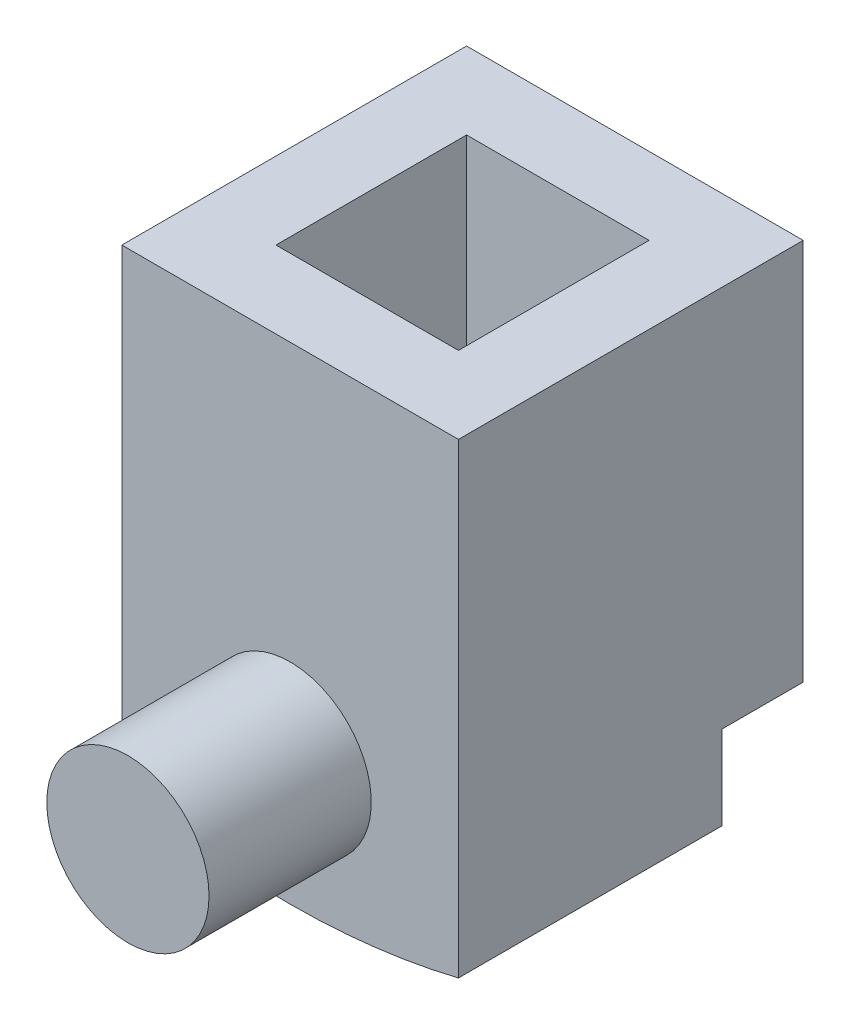
ISO-10303-21;
HEADER;
FILE_DESCRIPTION(('STEP AP214'),'2;1');
FILE_NAME('part.step','',(''),(''),'','','');
FILE_SCHEMA(('AUTOMOTIVE_DESIGN { 1 0 10303 214 1 1 1 1 }'));
ENDSEC;
DATA;
#1=APPLICATION_CONTEXT('core data for automotive mechanical design processes');
#2=APPLICATION_PROTOCOL_DEFINITION('international standard','automotive_design',2000,#1);
#3=PRODUCT_CONTEXT('',#1,'mechanical');
#4=PRODUCT('Part','Part','',(#3));
#5=PRODUCT_RELATED_PRODUCT_CATEGORY('part','',(#4));
#6=PRODUCT_DEFINITION_FORMATION('','',#4);
#7=PRODUCT_DEFINITION_CONTEXT('part definition',#1,'design');
#8=PRODUCT_DEFINITION('design','',#6,#7);
#9=PRODUCT_DEFINITION_SHAPE('','',#8);
#10=(LENGTH_UNIT() NAMED_UNIT(*) SI_UNIT(.MILLI.,.METRE.));
#11=(NAMED_UNIT(*) PLANE_ANGLE_UNIT() SI_UNIT($,.RADIAN.));
#12=(NAMED_UNIT(*) SI_UNIT($,.STERADIAN.) SOLID_ANGLE_UNIT());
#13=UNCERTAINTY_MEASURE_WITH_UNIT(LENGTH_MEASURE(1.E-05),#10,'distance_accuracy_value','');
#14=(GEOMETRIC_REPRESENTATION_CONTEXT(3) GLOBAL_UNCERTAINTY_ASSIGNED_CONTEXT((#13)) GLOBAL_UNIT_ASSIGNED_CONTEXT((#10,
#11,#12)) REPRESENTATION_CONTEXT('',''));
#15=CARTESIAN_POINT('',(0.,0.,0.));
#16=DIRECTION('',(0.,0.,1.));
#17=DIRECTION('',(1.,0.,0.));
#18=AXIS2_PLACEMENT_3D('',#15,#16,#17);
#19=CARTESIAN_POINT('',(-4.15,12.,4.25));
#20=DIRECTION('',(1.,0.,0.));
#21=DIRECTION('',(0.,0.,-1.));
#22=AXIS2_PLACEMENT_3D('',#19,#20,#21);
#23=PLANE('',#22);
#24=DIRECTION('',(0.,0.,-1.));
#25=VECTOR('',#24,1.);
#26=CARTESIAN_POINT('',(-4.15,2.56589473721308,-2.25));
#27=LINE('',#26,#25);
#28=CARTESIAN_POINT('',(-4.15,2.56589473721308,-2.25));
#29=VERTEX_POINT('',#28);
#30=CARTESIAN_POINT('',(-4.15,2.56589473721308,-4.25));
#31=VERTEX_POINT('',#30);
#32=EDGE_CURVE('E132',#29,#31,#27,.T.);
#33=ORIENTED_EDGE('',*,*,#32,.F.);
#34=DIRECTION('',(0.,1.,0.));
#35=VECTOR('',#34,1.);
#36=CARTESIAN_POINT('',(-4.15,0.,-2.25));
#37=LINE('',#36,#35);
#38=CARTESIAN_POINT('',(-4.15,0.499191195710718,-2.25));
#39=VERTEX_POINT('',#38);
#40=EDGE_CURVE('E133',#39,#29,#37,.T.);
#41=ORIENTED_EDGE('',*,*,#40,.F.);
#42=DIRECTION('',(0.,0.,-1.));
#43=VECTOR('',#42,1.);
#44=CARTESIAN_POINT('',(-4.15,0.499191195710718,5.75));
#45=LINE('',#44,#43);
#46=CARTESIAN_POINT('',(-4.15,0.499191195710718,4.25));
#47=VERTEX_POINT('',#46);
#48=EDGE_CURVE('E54',#47,#39,#45,.T.);
#49=ORIENTED_EDGE('',*,*,#48,.F.);
#50=DIRECTION('',(0.,-1.,0.));
#51=VECTOR('',#50,1.);
#52=CARTESIAN_POINT('',(-4.15,12.,4.25));
#53=LINE('',#52,#51);
#54=CARTESIAN_POINT('',(-4.15,12.,4.25));
#55=VERTEX_POINT('',#54);
#56=EDGE_CURVE('E211',#55,#47,#53,.T.);
#57=ORIENTED_EDGE('',*,*,#56,.F.);
#58=DIRECTION('',(0.,0.,1.));
#59=VECTOR('',#58,1.);
#60=CARTESIAN_POINT('',(-4.15,12.,4.25));
#61=LINE('',#60,#59);
#62=CARTESIAN_POINT('',(-4.15,12.,-4.25));
#63=VERTEX_POINT('',#62);
#64=EDGE_CURVE('E195',#63,#55,#61,.T.);
#65=ORIENTED_EDGE('',*,*,#64,.F.);
#66=DIRECTION('',(0.,-1.,0.));
#67=VECTOR('',#66,1.);
#68=CARTESIAN_POINT('',(-4.15,12.,-4.25));
#69=LINE('',#68,#67);
#70=EDGE_CURVE('E204',#63,#31,#69,.T.);
#71=ORIENTED_EDGE('',*,*,#70,.T.);
#72=EDGE_LOOP('',(#33,#41,#49,#57,#65,#71));
#73=FACE_BOUND('',#72,.T.);
#74=ADVANCED_FACE('F32',(#73),#23,.F.);
#75=CARTESIAN_POINT('',(4.15,12.,4.25));
#76=DIRECTION('',(-1.,0.,0.));
#77=DIRECTION('',(0.,0.,1.));
#78=AXIS2_PLACEMENT_3D('',#75,#76,#77);
#79=PLANE('',#78);
#80=DIRECTION('',(0.,0.,-1.));
#81=VECTOR('',#80,1.);
#82=CARTESIAN_POINT('',(4.15,2.56589473721308,-2.25));
#83=LINE('',#82,#81);
#84=CARTESIAN_POINT('',(4.15,2.56589473721308,-2.25));
#85=VERTEX_POINT('',#84);
#86=CARTESIAN_POINT('',(4.15,2.56589473721308,-4.25));
#87=VERTEX_POINT('',#86);
#88=EDGE_CURVE('E123',#85,#87,#83,.T.);
#89=ORIENTED_EDGE('',*,*,#88,.T.);
#90=DIRECTION('',(0.,-1.,0.));
#91=VECTOR('',#90,1.);
#92=CARTESIAN_POINT('',(4.15,12.,-4.25));
#93=LINE('',#92,#91);
#94=CARTESIAN_POINT('',(4.15,12.,-4.25));
#95=VERTEX_POINT('',#94);
#96=EDGE_CURVE('E207',#95,#87,#93,.T.);
#97=ORIENTED_EDGE('',*,*,#96,.F.);
#98=DIRECTION('',(0.,0.,-1.));
#99=VECTOR('',#98,1.);
#100=CARTESIAN_POINT('',(4.15,12.,4.25));
#101=LINE('',#100,#99);
#102=CARTESIAN_POINT('',(4.15,12.,4.25));
#103=VERTEX_POINT('',#102);
#104=EDGE_CURVE('E200',#103,#95,#101,.T.);
#105=ORIENTED_EDGE('',*,*,#104,.F.);
#106=DIRECTION('',(0.,-1.,0.));
#107=VECTOR('',#106,1.);
#108=CARTESIAN_POINT('',(4.15,12.,4.25));
#109=LINE('',#108,#107);
#110=CARTESIAN_POINT('',(4.15,0.499191195710718,4.25));
#111=VERTEX_POINT('',#110);
#112=EDGE_CURVE('E209',#103,#111,#109,.T.);
#113=ORIENTED_EDGE('',*,*,#112,.T.);
#114=DIRECTION('',(0.,0.,-1.));
#115=VECTOR('',#114,1.);
#116=CARTESIAN_POINT('',(4.15,0.499191195710718,5.75));
#117=LINE('',#116,#115);
#118=CARTESIAN_POINT('',(4.15,0.499191195710718,-2.25));
#119=VERTEX_POINT('',#118);
#120=EDGE_CURVE('E143',#119,#111,#117,.F.);
#121=ORIENTED_EDGE('',*,*,#120,.F.);
#122=DIRECTION('',(0.,-1.,0.));
#123=VECTOR('',#122,1.);
#124=CARTESIAN_POINT('',(4.15,0.,-2.25));
#125=LINE('',#124,#123);
#126=EDGE_CURVE('E46',#85,#119,#125,.T.);
#127=ORIENTED_EDGE('',*,*,#126,.F.);
#128=EDGE_LOOP('',(#89,#97,#105,#113,#121,#127));
#129=FACE_BOUND('',#128,.T.);
#130=ADVANCED_FACE('F141',(#129),#79,.F.);
#131=CARTESIAN_POINT('',(-4.15,12.,-4.25));
#132=DIRECTION('',(0.,0.,1.));
#133=DIRECTION('',(1.,0.,0.));
#134=AXIS2_PLACEMENT_3D('',#131,#132,#133);
#135=PLANE('',#134);
#136=CARTESIAN_POINT('',(0.,17.5,-4.25));
#137=DIRECTION('',(0.,0.,-1.));
#138=DIRECTION('',(-1.,0.,0.));
#139=AXIS2_PLACEMENT_3D('',#136,#137,#138);
#140=CIRCLE('',#139,15.5);
#141=EDGE_CURVE('E128',#87,#31,#140,.T.);
#142=ORIENTED_EDGE('',*,*,#141,.T.);
#143=ORIENTED_EDGE('',*,*,#70,.F.);
#144=DIRECTION('',(-1.,0.,0.));
#145=VECTOR('',#144,1.);
#146=CARTESIAN_POINT('',(-4.15,12.,-4.25));
#147=LINE('',#146,#145);
#148=EDGE_CURVE('E202',#95,#63,#147,.T.);
#149=ORIENTED_EDGE('',*,*,#148,.F.);
#150=ORIENTED_EDGE('',*,*,#96,.T.);
#151=EDGE_LOOP('',(#142,#143,#149,#150));
#152=FACE_BOUND('',#151,.T.);
#153=ADVANCED_FACE('F258',(#152),#135,.F.);
#154=CARTESIAN_POINT('',(2.25,12.,2.35));
#155=DIRECTION('',(-1.,0.,0.));
#156=DIRECTION('',(0.,0.,1.));
#157=AXIS2_PLACEMENT_3D('',#154,#155,#156);
#158=PLANE('',#157);
#159=DIRECTION('',(0.,-1.,0.));
#160=VECTOR('',#159,1.);
#161=CARTESIAN_POINT('',(2.25,12.,-2.35));
#162=LINE('',#161,#160);
#163=CARTESIAN_POINT('',(2.25,12.,-2.35));
#164=VERTEX_POINT('',#163);
#165=CARTESIAN_POINT('',(2.25,2.164175926935,-2.35));
#166=VERTEX_POINT('',#165);
#167=EDGE_CURVE('E192',#164,#166,#162,.T.);
#168=ORIENTED_EDGE('',*,*,#167,.T.);
#169=DIRECTION('',(0.,0.,-1.));
#170=VECTOR('',#169,1.);
#171=CARTESIAN_POINT('',(2.25,2.164175926935,-2.25));
#172=LINE('',#171,#170);
#173=CARTESIAN_POINT('',(2.25,2.164175926935,-2.25));
#174=VERTEX_POINT('',#173);
#175=EDGE_CURVE('E159',#166,#174,#172,.F.);
#176=ORIENTED_EDGE('',*,*,#175,.T.);
#177=DIRECTION('',(0.,-1.,0.));
#178=VECTOR('',#177,1.);
#179=CARTESIAN_POINT('',(2.25,12.,-2.25));
#180=LINE('',#179,#178);
#181=CARTESIAN_POINT('',(2.25,0.145245608191395,-2.25));
#182=VERTEX_POINT('',#181);
#183=EDGE_CURVE('E137',#174,#182,#180,.T.);
#184=ORIENTED_EDGE('',*,*,#183,.T.);
#185=DIRECTION('',(0.,0.,-1.));
#186=VECTOR('',#185,1.);
#187=CARTESIAN_POINT('',(2.25,0.145245608191395,5.75));
#188=LINE('',#187,#186);
#189=CARTESIAN_POINT('',(2.25,0.145245608191395,2.35));
#190=VERTEX_POINT('',#189);
#191=EDGE_CURVE('E167',#182,#190,#188,.F.);
#192=ORIENTED_EDGE('',*,*,#191,.T.);
#193=DIRECTION('',(0.,-1.,0.));
#194=VECTOR('',#193,1.);
#195=CARTESIAN_POINT('',(2.25,12.,2.35));
#196=LINE('',#195,#194);
#197=CARTESIAN_POINT('',(2.25,12.,2.35));
#198=VERTEX_POINT('',#197);
#199=EDGE_CURVE('E183',#198,#190,#196,.T.);
#200=ORIENTED_EDGE('',*,*,#199,.F.);
#201=DIRECTION('',(0.,0.,-1.));
#202=VECTOR('',#201,1.);
#203=CARTESIAN_POINT('',(2.25,12.,2.35));
#204=LINE('',#203,#202);
#205=EDGE_CURVE('E174',#198,#164,#204,.T.);
#206=ORIENTED_EDGE('',*,*,#205,.T.);
#207=EDGE_LOOP('',(#168,#176,#184,#192,#200,#206));
#208=FACE_BOUND('',#207,.T.);
#209=ADVANCED_FACE('F233',(#208),#158,.T.);
#210=CARTESIAN_POINT('',(-2.25,12.,-2.35));
#211=DIRECTION('',(0.,0.,1.));
#212=DIRECTION('',(1.,0.,0.));
#213=AXIS2_PLACEMENT_3D('',#210,#211,#212);
#214=PLANE('',#213);
#215=DIRECTION('',(0.,-1.,0.));
#216=VECTOR('',#215,1.);
#217=CARTESIAN_POINT('',(-2.25,12.,-2.35));
#218=LINE('',#217,#216);
#219=CARTESIAN_POINT('',(-2.25,12.,-2.35));
#220=VERTEX_POINT('',#219);
#221=CARTESIAN_POINT('',(-2.25,2.164175926935,-2.35));
#222=VERTEX_POINT('',#221);
#223=EDGE_CURVE('E189',#220,#222,#218,.T.);
#224=ORIENTED_EDGE('',*,*,#223,.T.);
#225=CARTESIAN_POINT('',(0.,17.5,-2.35));
#226=DIRECTION('',(0.,0.,1.));
#227=DIRECTION('',(1.,0.,0.));
#228=AXIS2_PLACEMENT_3D('',#225,#226,#227);
#229=CIRCLE('',#228,15.5);
#230=EDGE_CURVE('E156',#222,#166,#229,.T.);
#231=ORIENTED_EDGE('',*,*,#230,.T.);
#232=ORIENTED_EDGE('',*,*,#167,.F.);
#233=DIRECTION('',(-1.,0.,0.));
#234=VECTOR('',#233,1.);
#235=CARTESIAN_POINT('',(-2.25,12.,-2.35));
#236=LINE('',#235,#234);
#237=EDGE_CURVE('E176',#164,#220,#236,.T.);
#238=ORIENTED_EDGE('',*,*,#237,.T.);
#239=EDGE_LOOP('',(#224,#231,#232,#238));
#240=FACE_BOUND('',#239,.T.);
#241=ADVANCED_FACE('F237',(#240),#214,.T.);
#242=CARTESIAN_POINT('',(-2.25,12.,2.35));
#243=DIRECTION('',(1.,0.,0.));
#244=DIRECTION('',(0.,0.,-1.));
#245=AXIS2_PLACEMENT_3D('',#242,#243,#244);
#246=PLANE('',#245);
#247=DIRECTION('',(0.,1.,0.));
#248=VECTOR('',#247,1.);
#249=CARTESIAN_POINT('',(-2.25,12.,-2.25));
#250=LINE('',#249,#248);
#251=CARTESIAN_POINT('',(-2.25,0.145245608191395,-2.25));
#252=VERTEX_POINT('',#251);
#253=CARTESIAN_POINT('',(-2.25,2.164175926935,-2.25));
#254=VERTEX_POINT('',#253);
#255=EDGE_CURVE('E151',#252,#254,#250,.T.);
#256=ORIENTED_EDGE('',*,*,#255,.T.);
#257=DIRECTION('',(0.,0.,-1.));
#258=VECTOR('',#257,1.);
#259=CARTESIAN_POINT('',(-2.25,2.164175926935,-2.25));
#260=LINE('',#259,#258);
#261=EDGE_CURVE('E11',#254,#222,#260,.T.);
#262=ORIENTED_EDGE('',*,*,#261,.T.);
#263=ORIENTED_EDGE('',*,*,#223,.F.);
#264=DIRECTION('',(0.,0.,1.));
#265=VECTOR('',#264,1.);
#266=CARTESIAN_POINT('',(-2.25,12.,2.35));
#267=LINE('',#266,#265);
#268=CARTESIAN_POINT('',(-2.25,12.,2.35));
#269=VERTEX_POINT('',#268);
#270=EDGE_CURVE('E178',#220,#269,#267,.T.);
#271=ORIENTED_EDGE('',*,*,#270,.T.);
#272=DIRECTION('',(0.,-1.,0.));
#273=VECTOR('',#272,1.);
#274=CARTESIAN_POINT('',(-2.25,12.,2.35));
#275=LINE('',#274,#273);
#276=CARTESIAN_POINT('',(-2.25,0.145245608191399,2.35));
#277=VERTEX_POINT('',#276);
#278=EDGE_CURVE('E186',#269,#277,#275,.T.);
#279=ORIENTED_EDGE('',*,*,#278,.T.);
#280=DIRECTION('',(0.,0.,-1.));
#281=VECTOR('',#280,1.);
#282=CARTESIAN_POINT('',(-2.25,0.145245608191399,5.75));
#283=LINE('',#282,#281);
#284=EDGE_CURVE('E164',#277,#252,#283,.T.);
#285=ORIENTED_EDGE('',*,*,#284,.T.);
#286=EDGE_LOOP('',(#256,#262,#263,#271,#279,#285));
#287=FACE_BOUND('',#286,.T.);
#288=ADVANCED_FACE('F224',(#287),#246,.T.);
#289=CARTESIAN_POINT('',(0.,17.5,5.75));
#290=DIRECTION('',(0.,0.,-1.));
#291=DIRECTION('',(-1.,0.,0.));
#292=AXIS2_PLACEMENT_3D('',#289,#290,#291);
#293=CYLINDRICAL_SURFACE('',#292,17.5);
#294=ORIENTED_EDGE('',*,*,#48,.T.);
#295=CARTESIAN_POINT('',(0.,17.5,-2.25));
#296=DIRECTION('',(0.,0.,-1.));
#297=DIRECTION('',(-1.,0.,0.));
#298=AXIS2_PLACEMENT_3D('',#295,#296,#297);
#299=CIRCLE('',#298,17.5);
#300=EDGE_CURVE('E39',#39,#252,#299,.F.);
#301=ORIENTED_EDGE('',*,*,#300,.T.);
#302=ORIENTED_EDGE('',*,*,#284,.F.);
#303=CARTESIAN_POINT('',(0.,17.5,2.35));
#304=DIRECTION('',(0.,0.,-1.));
#305=DIRECTION('',(-1.,0.,0.));
#306=AXIS2_PLACEMENT_3D('',#303,#304,#305);
#307=CIRCLE('',#306,17.5);
#308=EDGE_CURVE('E213',#190,#277,#307,.T.);
#309=ORIENTED_EDGE('',*,*,#308,.F.);
#310=ORIENTED_EDGE('',*,*,#191,.F.);
#311=CARTESIAN_POINT('',(0.,17.5,-2.25));
#312=DIRECTION('',(0.,0.,-1.));
#313=DIRECTION('',(-1.,0.,0.));
#314=AXIS2_PLACEMENT_3D('',#311,#312,#313);
#315=CIRCLE('',#314,17.5);
#316=EDGE_CURVE('E144',#119,#182,#315,.T.);
#317=ORIENTED_EDGE('',*,*,#316,.F.);
#318=ORIENTED_EDGE('',*,*,#120,.T.);
#319=CARTESIAN_POINT('',(0.,17.5,4.25));
#320=DIRECTION('',(0.,0.,-1.));
#321=DIRECTION('',(-1.,0.,0.));
#322=AXIS2_PLACEMENT_3D('',#319,#320,#321);
#323=CIRCLE('',#322,17.5);
#324=EDGE_CURVE('E170',#111,#47,#323,.T.);
#325=ORIENTED_EDGE('',*,*,#324,.T.);
#326=EDGE_LOOP('',(#294,#301,#302,#309,#310,#317,#318,#325));
#327=FACE_BOUND('',#326,.T.);
#328=ADVANCED_FACE('F220',(#327),#293,.T.);
#329=CARTESIAN_POINT('',(-4.15,12.,4.25));
#330=DIRECTION('',(0.,0.,-1.));
#331=DIRECTION('',(-1.,0.,0.));
#332=AXIS2_PLACEMENT_3D('',#329,#330,#331);
#333=PLANE('',#332);
#334=ORIENTED_EDGE('',*,*,#324,.F.);
#335=ORIENTED_EDGE('',*,*,#112,.F.);
#336=DIRECTION('',(1.,0.,0.));
#337=VECTOR('',#336,1.);
#338=CARTESIAN_POINT('',(-4.15,12.,4.25));
#339=LINE('',#338,#337);
#340=EDGE_CURVE('E198',#55,#103,#339,.T.);
#341=ORIENTED_EDGE('',*,*,#340,.F.);
#342=ORIENTED_EDGE('',*,*,#56,.T.);
#343=EDGE_LOOP('',(#334,#335,#341,#342));
#344=FACE_BOUND('',#343,.T.);
#345=CARTESIAN_POINT('',(0.,3.175,4.25));
#346=DIRECTION('',(0.,0.,-1.));
#347=DIRECTION('',(-1.,0.,0.));
#348=AXIS2_PLACEMENT_3D('',#345,#346,#347);
#349=CIRCLE('',#348,2.);
#350=CARTESIAN_POINT('',(-2.,3.175,4.25));
#351=VERTEX_POINT('',#350);
#352=EDGE_CURVE('E216',#351,#351,#349,.F.);
#353=ORIENTED_EDGE('',*,*,#352,.F.);
#354=EDGE_LOOP('',(#353));
#355=FACE_BOUND('',#354,.T.);
#356=ADVANCED_FACE('F242',(#344,#355),#333,.F.);
#357=CARTESIAN_POINT('',(0.,12.,0.));
#358=DIRECTION('',(0.,-1.,0.));
#359=DIRECTION('',(0.,0.,-1.));
#360=AXIS2_PLACEMENT_3D('',#357,#358,#359);
#361=PLANE('',#360);
#362=ORIENTED_EDGE('',*,*,#64,.T.);
#363=ORIENTED_EDGE('',*,*,#340,.T.);
#364=ORIENTED_EDGE('',*,*,#104,.T.);
#365=ORIENTED_EDGE('',*,*,#148,.T.);
#366=EDGE_LOOP('',(#362,#363,#364,#365));
#367=FACE_BOUND('',#366,.T.);
#368=ORIENTED_EDGE('',*,*,#205,.F.);
#369=DIRECTION('',(1.,0.,0.));
#370=VECTOR('',#369,1.);
#371=CARTESIAN_POINT('',(-2.25,12.,2.35));
#372=LINE('',#371,#370);
#373=EDGE_CURVE('E181',#269,#198,#372,.T.);
#374=ORIENTED_EDGE('',*,*,#373,.F.);
#375=ORIENTED_EDGE('',*,*,#270,.F.);
#376=ORIENTED_EDGE('',*,*,#237,.F.);
#377=EDGE_LOOP('',(#368,#374,#375,#376));
#378=FACE_BOUND('',#377,.T.);
#379=ADVANCED_FACE('F240',(#367,#378),#361,.F.);
#380=CARTESIAN_POINT('',(-2.25,12.,2.35));
#381=DIRECTION('',(0.,0.,-1.));
#382=DIRECTION('',(-1.,0.,0.));
#383=AXIS2_PLACEMENT_3D('',#380,#381,#382);
#384=PLANE('',#383);
#385=ORIENTED_EDGE('',*,*,#199,.T.);
#386=ORIENTED_EDGE('',*,*,#308,.T.);
#387=ORIENTED_EDGE('',*,*,#278,.F.);
#388=ORIENTED_EDGE('',*,*,#373,.T.);
#389=EDGE_LOOP('',(#385,#386,#387,#388));
#390=FACE_BOUND('',#389,.T.);
#391=ADVANCED_FACE('F229',(#390),#384,.T.);
#392=CARTESIAN_POINT('',(0.,3.175,8.25));
#393=DIRECTION('',(0.,0.,-1.));
#394=DIRECTION('',(-1.,0.,0.));
#395=AXIS2_PLACEMENT_3D('',#392,#393,#394);
#396=CYLINDRICAL_SURFACE('',#395,2.);
#397=CARTESIAN_POINT('',(0.,3.175,8.25));
#398=DIRECTION('',(0.,0.,1.));
#399=DIRECTION('',(1.,0.,0.));
#400=AXIS2_PLACEMENT_3D('',#397,#398,#399);
#401=CIRCLE('',#400,2.);
#402=CARTESIAN_POINT('',(2.,3.175,8.25));
#403=VERTEX_POINT('',#402);
#404=EDGE_CURVE('E161',#403,#403,#401,.T.);
#405=ORIENTED_EDGE('',*,*,#404,.F.);
#406=EDGE_LOOP('',(#405));
#407=FACE_BOUND('',#406,.T.);
#408=ORIENTED_EDGE('',*,*,#352,.T.);
#409=EDGE_LOOP('',(#408));
#410=FACE_BOUND('',#409,.T.);
#411=ADVANCED_FACE('F249',(#407,#410),#396,.T.);
#412=CARTESIAN_POINT('',(0.,3.175,8.25));
#413=DIRECTION('',(0.,0.,1.));
#414=DIRECTION('',(1.,0.,0.));
#415=AXIS2_PLACEMENT_3D('',#412,#413,#414);
#416=PLANE('',#415);
#417=ORIENTED_EDGE('',*,*,#404,.T.);
#418=EDGE_LOOP('',(#417));
#419=FACE_BOUND('',#418,.T.);
#420=ADVANCED_FACE('F273',(#419),#416,.T.);
#421=CARTESIAN_POINT('',(0.,0.,-2.25));
#422=DIRECTION('',(0.,0.,-1.));
#423=DIRECTION('',(-1.,0.,0.));
#424=AXIS2_PLACEMENT_3D('',#421,#422,#423);
#425=PLANE('',#424);
#426=CARTESIAN_POINT('',(0.,17.5,-2.25));
#427=DIRECTION('',(0.,0.,-1.));
#428=DIRECTION('',(-1.,0.,0.));
#429=AXIS2_PLACEMENT_3D('',#426,#427,#428);
#430=CIRCLE('',#429,15.5);
#431=EDGE_CURVE('E125',#85,#174,#430,.T.);
#432=ORIENTED_EDGE('',*,*,#431,.F.);
#433=ORIENTED_EDGE('',*,*,#126,.T.);
#434=ORIENTED_EDGE('',*,*,#316,.T.);
#435=ORIENTED_EDGE('',*,*,#183,.F.);
#436=EDGE_LOOP('',(#432,#433,#434,#435));
#437=FACE_BOUND('',#436,.T.);
#438=ADVANCED_FACE('F135',(#437),#425,.T.);
#439=CARTESIAN_POINT('',(0.,17.5,-2.25));
#440=DIRECTION('',(0.,0.,-1.));
#441=DIRECTION('',(-1.,0.,0.));
#442=AXIS2_PLACEMENT_3D('',#439,#440,#441);
#443=CYLINDRICAL_SURFACE('',#442,15.5);
#444=ORIENTED_EDGE('',*,*,#230,.F.);
#445=ORIENTED_EDGE('',*,*,#261,.F.);
#446=EDGE_CURVE('E138',#254,#29,#430,.T.);
#447=ORIENTED_EDGE('',*,*,#446,.T.);
#448=ORIENTED_EDGE('',*,*,#32,.T.);
#449=ORIENTED_EDGE('',*,*,#141,.F.);
#450=ORIENTED_EDGE('',*,*,#88,.F.);
#451=ORIENTED_EDGE('',*,*,#431,.T.);
#452=ORIENTED_EDGE('',*,*,#175,.F.);
#453=EDGE_LOOP('',(#444,#445,#447,#448,#449,#450,#451,#452));
#454=FACE_BOUND('',#453,.T.);
#455=ADVANCED_FACE('F124',(#454),#443,.T.);
#456=ORIENTED_EDGE('',*,*,#300,.F.);
#457=ORIENTED_EDGE('',*,*,#40,.T.);
#458=ORIENTED_EDGE('',*,*,#446,.F.);
#459=ORIENTED_EDGE('',*,*,#255,.F.);
#460=EDGE_LOOP('',(#456,#457,#458,#459));
#461=FACE_BOUND('',#460,.T.);
#462=ADVANCED_FACE('F363',(#461),#425,.T.);
#463=CLOSED_SHELL('',(#74,#130,#153,#209,#241,#288,#328,#356,#379,#391,#411,#420,#438,#455,#462));
#464=MANIFOLD_SOLID_BREP('B2',#463);
#465=ADVANCED_BREP_SHAPE_REPRESENTATION('',(#18,#464),#14);
#466=SHAPE_DEFINITION_REPRESENTATION(#9,#465);
ENDSEC;
END-ISO-10303-21;
